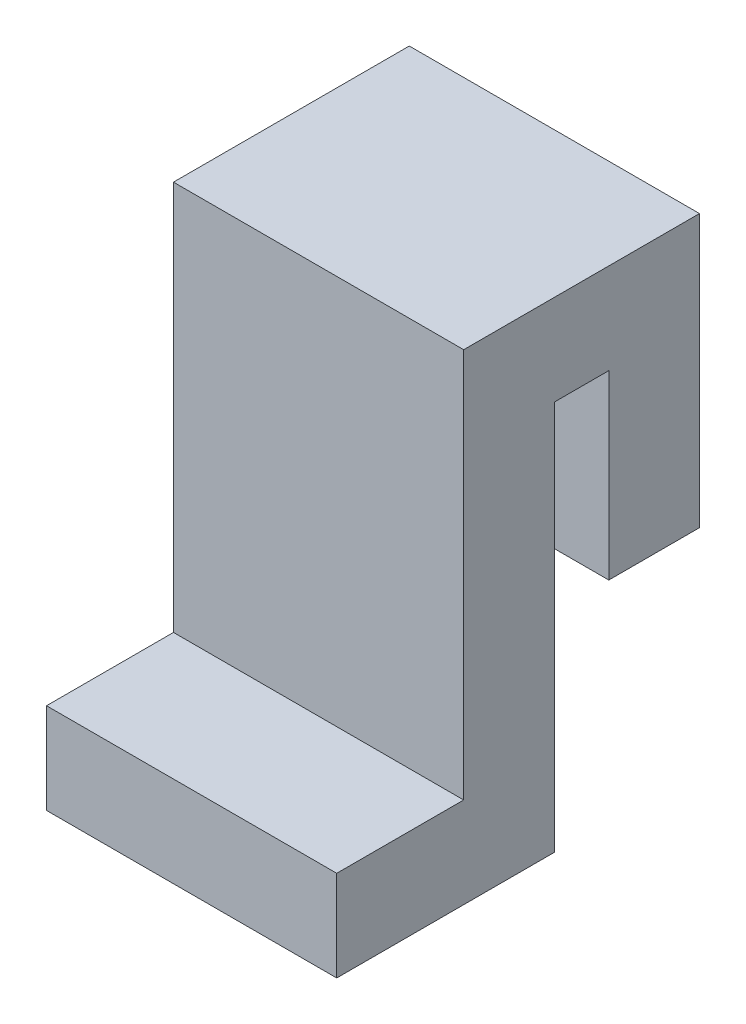
ISO-10303-21;
HEADER;
FILE_DESCRIPTION(('STEP AP214'),'2;1');
FILE_NAME('part.step','',(''),(''),'','','');
FILE_SCHEMA(('AUTOMOTIVE_DESIGN { 1 0 10303 214 1 1 1 1 }'));
ENDSEC;
DATA;
#1=APPLICATION_CONTEXT('core data for automotive mechanical design processes');
#2=APPLICATION_PROTOCOL_DEFINITION('international standard','automotive_design',2000,#1);
#3=PRODUCT_CONTEXT('',#1,'mechanical');
#4=PRODUCT('Part','Part','',(#3));
#5=PRODUCT_RELATED_PRODUCT_CATEGORY('part','',(#4));
#6=PRODUCT_DEFINITION_FORMATION('','',#4);
#7=PRODUCT_DEFINITION_CONTEXT('part definition',#1,'design');
#8=PRODUCT_DEFINITION('design','',#6,#7);
#9=PRODUCT_DEFINITION_SHAPE('','',#8);
#10=(LENGTH_UNIT() NAMED_UNIT(*) SI_UNIT(.MILLI.,.METRE.));
#11=(NAMED_UNIT(*) PLANE_ANGLE_UNIT() SI_UNIT($,.RADIAN.));
#12=(NAMED_UNIT(*) SI_UNIT($,.STERADIAN.) SOLID_ANGLE_UNIT());
#13=UNCERTAINTY_MEASURE_WITH_UNIT(LENGTH_MEASURE(1.E-05),#10,'distance_accuracy_value','');
#14=(GEOMETRIC_REPRESENTATION_CONTEXT(3) GLOBAL_UNCERTAINTY_ASSIGNED_CONTEXT((#13)) GLOBAL_UNIT_ASSIGNED_CONTEXT((#10,
#11,#12)) REPRESENTATION_CONTEXT('',''));
#15=CARTESIAN_POINT('',(0.,0.,0.));
#16=DIRECTION('',(0.,0.,1.));
#17=DIRECTION('',(1.,0.,0.));
#18=AXIS2_PLACEMENT_3D('',#15,#16,#17);
#19=CARTESIAN_POINT('',(203.2,-273.05,241.3));
#20=DIRECTION('',(0.,0.,-1.));
#21=DIRECTION('',(0.,1.,0.));
#22=AXIS2_PLACEMENT_3D('',#19,#20,#21);
#23=PLANE('',#22);
#24=DIRECTION('',(0.,-1.,0.));
#25=VECTOR('',#24,1.);
#26=CARTESIAN_POINT('',(-203.2,-273.05,241.3));
#27=LINE('',#26,#25);
#28=CARTESIAN_POINT('',(-203.2,-273.05,241.3));
#29=VERTEX_POINT('',#28);
#30=CARTESIAN_POINT('',(-203.2,-400.05,241.3));
#31=VERTEX_POINT('',#30);
#32=EDGE_CURVE('E142',#29,#31,#27,.T.);
#33=ORIENTED_EDGE('',*,*,#32,.T.);
#34=DIRECTION('',(-1.,0.,0.));
#35=VECTOR('',#34,1.);
#36=CARTESIAN_POINT('',(203.2,-400.05,241.3));
#37=LINE('',#36,#35);
#38=CARTESIAN_POINT('',(203.2,-400.05,241.3));
#39=VERTEX_POINT('',#38);
#40=EDGE_CURVE('E11',#39,#31,#37,.T.);
#41=ORIENTED_EDGE('',*,*,#40,.F.);
#42=DIRECTION('',(0.,-1.,0.));
#43=VECTOR('',#42,1.);
#44=CARTESIAN_POINT('',(203.2,-273.05,241.3));
#45=LINE('',#44,#43);
#46=CARTESIAN_POINT('',(203.2,-273.05,241.3));
#47=VERTEX_POINT('',#46);
#48=EDGE_CURVE('E163',#47,#39,#45,.T.);
#49=ORIENTED_EDGE('',*,*,#48,.F.);
#50=DIRECTION('',(-1.,0.,0.));
#51=VECTOR('',#50,1.);
#52=CARTESIAN_POINT('',(203.2,-273.05,241.3));
#53=LINE('',#52,#51);
#54=EDGE_CURVE('E138',#47,#29,#53,.T.);
#55=ORIENTED_EDGE('',*,*,#54,.T.);
#56=EDGE_LOOP('',(#33,#41,#49,#55));
#57=FACE_BOUND('',#56,.T.);
#58=ADVANCED_FACE('F35',(#57),#23,.F.);
#59=CARTESIAN_POINT('',(203.2,-400.05,241.3));
#60=DIRECTION('',(0.,1.,0.));
#61=DIRECTION('',(0.,0.,1.));
#62=AXIS2_PLACEMENT_3D('',#59,#60,#61);
#63=PLANE('',#62);
#64=DIRECTION('',(0.,0.,-1.));
#65=VECTOR('',#64,1.);
#66=CARTESIAN_POINT('',(-203.2,-400.05,241.3));
#67=LINE('',#66,#65);
#68=CARTESIAN_POINT('',(-203.2,-400.05,-63.5));
#69=VERTEX_POINT('',#68);
#70=EDGE_CURVE('E145',#31,#69,#67,.T.);
#71=ORIENTED_EDGE('',*,*,#70,.T.);
#72=DIRECTION('',(-1.,0.,0.));
#73=VECTOR('',#72,1.);
#74=CARTESIAN_POINT('',(203.2,-400.05,-63.5));
#75=LINE('',#74,#73);
#76=CARTESIAN_POINT('',(203.2,-400.05,-63.5));
#77=VERTEX_POINT('',#76);
#78=EDGE_CURVE('E43',#77,#69,#75,.T.);
#79=ORIENTED_EDGE('',*,*,#78,.F.);
#80=DIRECTION('',(0.,0.,-1.));
#81=VECTOR('',#80,1.);
#82=CARTESIAN_POINT('',(203.2,-400.05,241.3));
#83=LINE('',#82,#81);
#84=EDGE_CURVE('E100',#39,#77,#83,.T.);
#85=ORIENTED_EDGE('',*,*,#84,.F.);
#86=ORIENTED_EDGE('',*,*,#40,.T.);
#87=EDGE_LOOP('',(#71,#79,#85,#86));
#88=FACE_BOUND('',#87,.T.);
#89=ADVANCED_FACE('F184',(#88),#63,.F.);
#90=CARTESIAN_POINT('',(203.2,-273.05,-63.5));
#91=DIRECTION('',(0.,0.,1.));
#92=DIRECTION('',(1.,0.,0.));
#93=AXIS2_PLACEMENT_3D('',#90,#91,#92);
#94=PLANE('',#93);
#95=DIRECTION('',(0.,1.,0.));
#96=VECTOR('',#95,1.);
#97=CARTESIAN_POINT('',(-203.2,-273.05,-63.5));
#98=LINE('',#97,#96);
#99=CARTESIAN_POINT('',(-203.2,146.05,-63.5));
#100=VERTEX_POINT('',#99);
#101=EDGE_CURVE('E148',#69,#100,#98,.T.);
#102=ORIENTED_EDGE('',*,*,#101,.T.);
#103=DIRECTION('',(-1.,0.,0.));
#104=VECTOR('',#103,1.);
#105=CARTESIAN_POINT('',(203.2,146.05,-63.5));
#106=LINE('',#105,#104);
#107=CARTESIAN_POINT('',(203.2,146.05,-63.5));
#108=VERTEX_POINT('',#107);
#109=EDGE_CURVE('E176',#108,#100,#106,.T.);
#110=ORIENTED_EDGE('',*,*,#109,.F.);
#111=DIRECTION('',(0.,1.,0.));
#112=VECTOR('',#111,1.);
#113=CARTESIAN_POINT('',(203.2,-273.05,-63.5));
#114=LINE('',#113,#112);
#115=EDGE_CURVE('E183',#77,#108,#114,.T.);
#116=ORIENTED_EDGE('',*,*,#115,.F.);
#117=ORIENTED_EDGE('',*,*,#78,.T.);
#118=EDGE_LOOP('',(#102,#110,#116,#117));
#119=FACE_BOUND('',#118,.T.);
#120=ADVANCED_FACE('F181',(#119),#94,.F.);
#121=CARTESIAN_POINT('',(203.2,146.05,-63.5));
#122=DIRECTION('',(0.,1.,0.));
#123=DIRECTION('',(0.,0.,1.));
#124=AXIS2_PLACEMENT_3D('',#121,#122,#123);
#125=PLANE('',#124);
#126=DIRECTION('',(0.,0.,-1.));
#127=VECTOR('',#126,1.);
#128=CARTESIAN_POINT('',(-203.2,146.05,-63.5));
#129=LINE('',#128,#127);
#130=CARTESIAN_POINT('',(-203.2,146.05,-139.7));
#131=VERTEX_POINT('',#130);
#132=EDGE_CURVE('E150',#100,#131,#129,.T.);
#133=ORIENTED_EDGE('',*,*,#132,.T.);
#134=DIRECTION('',(-1.,0.,0.));
#135=VECTOR('',#134,1.);
#136=CARTESIAN_POINT('',(203.2,146.05,-139.7));
#137=LINE('',#136,#135);
#138=CARTESIAN_POINT('',(203.2,146.05,-139.7));
#139=VERTEX_POINT('',#138);
#140=EDGE_CURVE('E173',#139,#131,#137,.T.);
#141=ORIENTED_EDGE('',*,*,#140,.F.);
#142=DIRECTION('',(0.,0.,-1.));
#143=VECTOR('',#142,1.);
#144=CARTESIAN_POINT('',(203.2,146.05,-63.5));
#145=LINE('',#144,#143);
#146=EDGE_CURVE('E203',#108,#139,#145,.T.);
#147=ORIENTED_EDGE('',*,*,#146,.F.);
#148=ORIENTED_EDGE('',*,*,#109,.T.);
#149=EDGE_LOOP('',(#133,#141,#147,#148));
#150=FACE_BOUND('',#149,.T.);
#151=ADVANCED_FACE('F194',(#150),#125,.F.);
#152=CARTESIAN_POINT('',(203.2,146.05,-139.7));
#153=DIRECTION('',(0.,0.,-1.));
#154=DIRECTION('',(0.,1.,0.));
#155=AXIS2_PLACEMENT_3D('',#152,#153,#154);
#156=PLANE('',#155);
#157=DIRECTION('',(0.,-1.,0.));
#158=VECTOR('',#157,1.);
#159=CARTESIAN_POINT('',(-203.2,146.05,-139.7));
#160=LINE('',#159,#158);
#161=CARTESIAN_POINT('',(-203.2,-107.95,-139.7));
#162=VERTEX_POINT('',#161);
#163=EDGE_CURVE('E152',#131,#162,#160,.T.);
#164=ORIENTED_EDGE('',*,*,#163,.T.);
#165=DIRECTION('',(-1.,0.,0.));
#166=VECTOR('',#165,1.);
#167=CARTESIAN_POINT('',(203.2,-107.95,-139.7));
#168=LINE('',#167,#166);
#169=CARTESIAN_POINT('',(203.2,-107.95,-139.7));
#170=VERTEX_POINT('',#169);
#171=EDGE_CURVE('E170',#170,#162,#168,.T.);
#172=ORIENTED_EDGE('',*,*,#171,.F.);
#173=DIRECTION('',(0.,-1.,0.));
#174=VECTOR('',#173,1.);
#175=CARTESIAN_POINT('',(203.2,146.05,-139.7));
#176=LINE('',#175,#174);
#177=EDGE_CURVE('E200',#139,#170,#176,.T.);
#178=ORIENTED_EDGE('',*,*,#177,.F.);
#179=ORIENTED_EDGE('',*,*,#140,.T.);
#180=EDGE_LOOP('',(#164,#172,#178,#179));
#181=FACE_BOUND('',#180,.T.);
#182=ADVANCED_FACE('F198',(#181),#156,.F.);
#183=CARTESIAN_POINT('',(203.2,-107.95,-266.7));
#184=DIRECTION('',(0.,1.,0.));
#185=DIRECTION('',(0.,0.,1.));
#186=AXIS2_PLACEMENT_3D('',#183,#184,#185);
#187=PLANE('',#186);
#188=DIRECTION('',(0.,0.,-1.));
#189=VECTOR('',#188,1.);
#190=CARTESIAN_POINT('',(-203.2,-107.95,-266.7));
#191=LINE('',#190,#189);
#192=CARTESIAN_POINT('',(-203.2,-107.95,-266.7));
#193=VERTEX_POINT('',#192);
#194=EDGE_CURVE('E154',#162,#193,#191,.T.);
#195=ORIENTED_EDGE('',*,*,#194,.T.);
#196=DIRECTION('',(-1.,0.,0.));
#197=VECTOR('',#196,1.);
#198=CARTESIAN_POINT('',(203.2,-107.95,-266.7));
#199=LINE('',#198,#197);
#200=CARTESIAN_POINT('',(203.2,-107.95,-266.7));
#201=VERTEX_POINT('',#200);
#202=EDGE_CURVE('E167',#201,#193,#199,.T.);
#203=ORIENTED_EDGE('',*,*,#202,.F.);
#204=DIRECTION('',(0.,0.,-1.));
#205=VECTOR('',#204,1.);
#206=CARTESIAN_POINT('',(203.2,-107.95,-266.7));
#207=LINE('',#206,#205);
#208=EDGE_CURVE('E202',#170,#201,#207,.T.);
#209=ORIENTED_EDGE('',*,*,#208,.F.);
#210=ORIENTED_EDGE('',*,*,#171,.T.);
#211=EDGE_LOOP('',(#195,#203,#209,#210));
#212=FACE_BOUND('',#211,.T.);
#213=ADVANCED_FACE('F217',(#212),#187,.F.);
#214=CARTESIAN_POINT('',(203.2,273.05,-266.7));
#215=DIRECTION('',(0.,0.,1.));
#216=DIRECTION('',(0.,-1.,0.));
#217=AXIS2_PLACEMENT_3D('',#214,#215,#216);
#218=PLANE('',#217);
#219=DIRECTION('',(0.,1.,0.));
#220=VECTOR('',#219,1.);
#221=CARTESIAN_POINT('',(-203.2,273.05,-266.7));
#222=LINE('',#221,#220);
#223=CARTESIAN_POINT('',(-203.2,273.05,-266.7));
#224=VERTEX_POINT('',#223);
#225=EDGE_CURVE('E157',#193,#224,#222,.T.);
#226=ORIENTED_EDGE('',*,*,#225,.T.);
#227=DIRECTION('',(-1.,0.,0.));
#228=VECTOR('',#227,1.);
#229=CARTESIAN_POINT('',(203.2,273.05,-266.7));
#230=LINE('',#229,#228);
#231=CARTESIAN_POINT('',(203.2,273.05,-266.7));
#232=VERTEX_POINT('',#231);
#233=EDGE_CURVE('E133',#232,#224,#230,.T.);
#234=ORIENTED_EDGE('',*,*,#233,.F.);
#235=DIRECTION('',(0.,1.,0.));
#236=VECTOR('',#235,1.);
#237=CARTESIAN_POINT('',(203.2,146.05,-266.7));
#238=LINE('',#237,#236);
#239=EDGE_CURVE('E125',#201,#232,#238,.T.);
#240=ORIENTED_EDGE('',*,*,#239,.F.);
#241=ORIENTED_EDGE('',*,*,#202,.T.);
#242=EDGE_LOOP('',(#226,#234,#240,#241));
#243=FACE_BOUND('',#242,.T.);
#244=ADVANCED_FACE('F214',(#243),#218,.F.);
#245=CARTESIAN_POINT('',(203.2,273.05,-63.5));
#246=DIRECTION('',(0.,-1.,0.));
#247=DIRECTION('',(0.,0.,-1.));
#248=AXIS2_PLACEMENT_3D('',#245,#246,#247);
#249=PLANE('',#248);
#250=DIRECTION('',(0.,0.,1.));
#251=VECTOR('',#250,1.);
#252=CARTESIAN_POINT('',(-203.2,273.05,-63.5));
#253=LINE('',#252,#251);
#254=CARTESIAN_POINT('',(-203.2,273.05,63.5));
#255=VERTEX_POINT('',#254);
#256=EDGE_CURVE('E132',#224,#255,#253,.T.);
#257=ORIENTED_EDGE('',*,*,#256,.T.);
#258=DIRECTION('',(-1.,0.,0.));
#259=VECTOR('',#258,1.);
#260=CARTESIAN_POINT('',(203.2,273.05,63.5));
#261=LINE('',#260,#259);
#262=CARTESIAN_POINT('',(203.2,273.05,63.5));
#263=VERTEX_POINT('',#262);
#264=EDGE_CURVE('E130',#263,#255,#261,.T.);
#265=ORIENTED_EDGE('',*,*,#264,.F.);
#266=DIRECTION('',(0.,0.,1.));
#267=VECTOR('',#266,1.);
#268=CARTESIAN_POINT('',(203.2,273.05,-63.5));
#269=LINE('',#268,#267);
#270=EDGE_CURVE('E119',#232,#263,#269,.T.);
#271=ORIENTED_EDGE('',*,*,#270,.F.);
#272=ORIENTED_EDGE('',*,*,#233,.T.);
#273=EDGE_LOOP('',(#257,#265,#271,#272));
#274=FACE_BOUND('',#273,.T.);
#275=ADVANCED_FACE('F131',(#274),#249,.F.);
#276=CARTESIAN_POINT('',(203.2,-273.05,63.5));
#277=DIRECTION('',(0.,0.,-1.));
#278=DIRECTION('',(0.,1.,0.));
#279=AXIS2_PLACEMENT_3D('',#276,#277,#278);
#280=PLANE('',#279);
#281=DIRECTION('',(0.,-1.,0.));
#282=VECTOR('',#281,1.);
#283=CARTESIAN_POINT('',(-203.2,-273.05,63.5));
#284=LINE('',#283,#282);
#285=CARTESIAN_POINT('',(-203.2,-273.05,63.5));
#286=VERTEX_POINT('',#285);
#287=EDGE_CURVE('E86',#255,#286,#284,.T.);
#288=ORIENTED_EDGE('',*,*,#287,.T.);
#289=DIRECTION('',(-1.,0.,0.));
#290=VECTOR('',#289,1.);
#291=CARTESIAN_POINT('',(203.2,-273.05,63.5));
#292=LINE('',#291,#290);
#293=CARTESIAN_POINT('',(203.2,-273.05,63.5));
#294=VERTEX_POINT('',#293);
#295=EDGE_CURVE('E134',#294,#286,#292,.T.);
#296=ORIENTED_EDGE('',*,*,#295,.F.);
#297=DIRECTION('',(0.,-1.,0.));
#298=VECTOR('',#297,1.);
#299=CARTESIAN_POINT('',(203.2,-273.05,63.5));
#300=LINE('',#299,#298);
#301=EDGE_CURVE('E123',#263,#294,#300,.T.);
#302=ORIENTED_EDGE('',*,*,#301,.F.);
#303=ORIENTED_EDGE('',*,*,#264,.T.);
#304=EDGE_LOOP('',(#288,#296,#302,#303));
#305=FACE_BOUND('',#304,.T.);
#306=ADVANCED_FACE('F136',(#305),#280,.F.);
#307=CARTESIAN_POINT('',(203.2,-273.05,241.3));
#308=DIRECTION('',(0.,-1.,0.));
#309=DIRECTION('',(0.,0.,-1.));
#310=AXIS2_PLACEMENT_3D('',#307,#308,#309);
#311=PLANE('',#310);
#312=DIRECTION('',(0.,0.,1.));
#313=VECTOR('',#312,1.);
#314=CARTESIAN_POINT('',(-203.2,-273.05,241.3));
#315=LINE('',#314,#313);
#316=EDGE_CURVE('E92',#286,#29,#315,.T.);
#317=ORIENTED_EDGE('',*,*,#316,.T.);
#318=ORIENTED_EDGE('',*,*,#54,.F.);
#319=DIRECTION('',(0.,0.,1.));
#320=VECTOR('',#319,1.);
#321=CARTESIAN_POINT('',(203.2,-273.05,241.3));
#322=LINE('',#321,#320);
#323=EDGE_CURVE('E51',#294,#47,#322,.T.);
#324=ORIENTED_EDGE('',*,*,#323,.F.);
#325=ORIENTED_EDGE('',*,*,#295,.T.);
#326=EDGE_LOOP('',(#317,#318,#324,#325));
#327=FACE_BOUND('',#326,.T.);
#328=ADVANCED_FACE('F212',(#327),#311,.F.);
#329=CARTESIAN_POINT('',(203.2,0.,0.));
#330=DIRECTION('',(1.,0.,0.));
#331=DIRECTION('',(0.,0.,-1.));
#332=AXIS2_PLACEMENT_3D('',#329,#330,#331);
#333=PLANE('',#332);
#334=ORIENTED_EDGE('',*,*,#48,.T.);
#335=ORIENTED_EDGE('',*,*,#84,.T.);
#336=ORIENTED_EDGE('',*,*,#115,.T.);
#337=ORIENTED_EDGE('',*,*,#146,.T.);
#338=ORIENTED_EDGE('',*,*,#177,.T.);
#339=ORIENTED_EDGE('',*,*,#208,.T.);
#340=ORIENTED_EDGE('',*,*,#239,.T.);
#341=ORIENTED_EDGE('',*,*,#270,.T.);
#342=ORIENTED_EDGE('',*,*,#301,.T.);
#343=ORIENTED_EDGE('',*,*,#323,.T.);
#344=EDGE_LOOP('',(#334,#335,#336,#337,#338,#339,#340,#341,#342,#343));
#345=FACE_BOUND('',#344,.T.);
#346=ADVANCED_FACE('F121',(#345),#333,.T.);
#347=CARTESIAN_POINT('',(-203.2,0.,0.));
#348=DIRECTION('',(1.,0.,0.));
#349=DIRECTION('',(0.,0.,-1.));
#350=AXIS2_PLACEMENT_3D('',#347,#348,#349);
#351=PLANE('',#350);
#352=ORIENTED_EDGE('',*,*,#32,.F.);
#353=ORIENTED_EDGE('',*,*,#316,.F.);
#354=ORIENTED_EDGE('',*,*,#287,.F.);
#355=ORIENTED_EDGE('',*,*,#256,.F.);
#356=ORIENTED_EDGE('',*,*,#225,.F.);
#357=ORIENTED_EDGE('',*,*,#194,.F.);
#358=ORIENTED_EDGE('',*,*,#163,.F.);
#359=ORIENTED_EDGE('',*,*,#132,.F.);
#360=ORIENTED_EDGE('',*,*,#101,.F.);
#361=ORIENTED_EDGE('',*,*,#70,.F.);
#362=EDGE_LOOP('',(#352,#353,#354,#355,#356,#357,#358,#359,#360,#361));
#363=FACE_BOUND('',#362,.T.);
#364=ADVANCED_FACE('F188',(#363),#351,.F.);
#365=CLOSED_SHELL('',(#58,#89,#120,#151,#182,#213,#244,#275,#306,#328,#346,#364));
#366=MANIFOLD_SOLID_BREP('B2',#365);
#367=ADVANCED_BREP_SHAPE_REPRESENTATION('',(#18,#366),#14);
#368=SHAPE_DEFINITION_REPRESENTATION(#9,#367);
ENDSEC;
END-ISO-10303-21;
